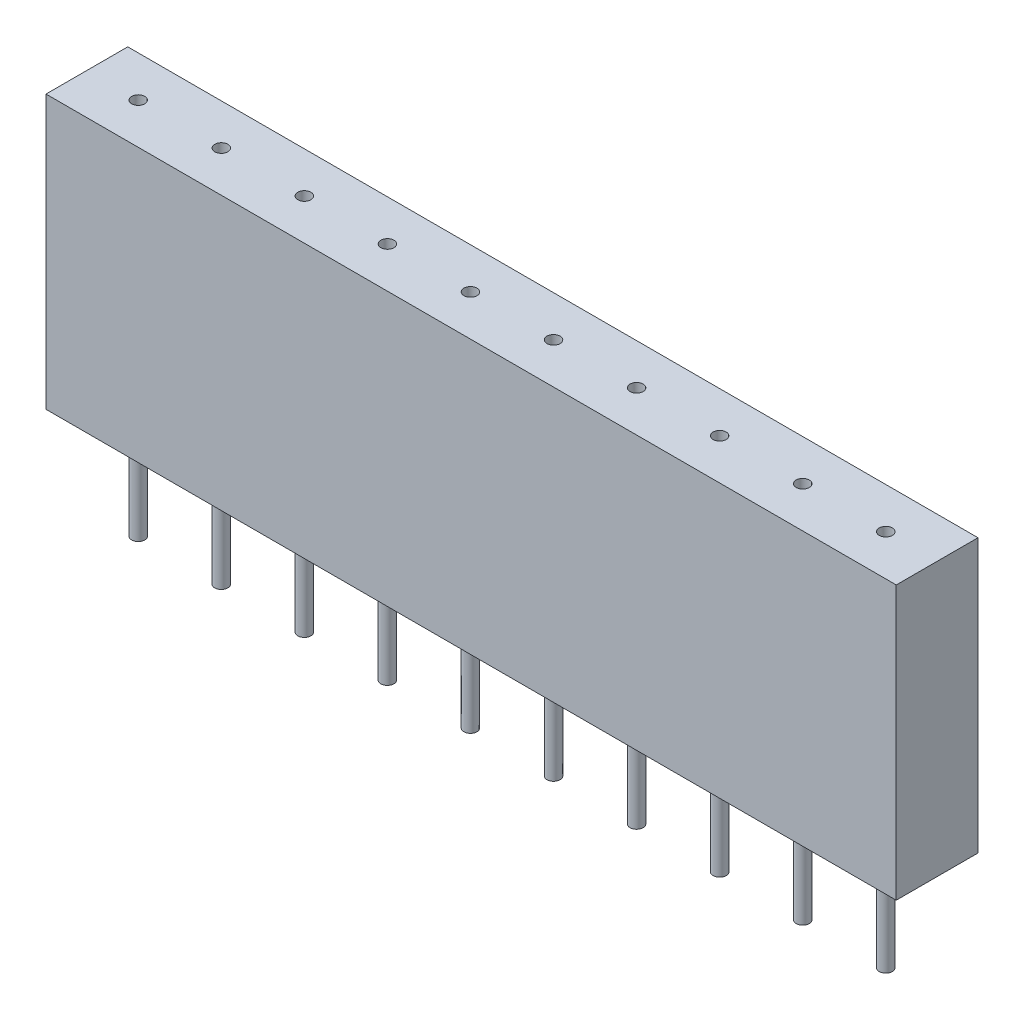
ISO-10303-21;
HEADER;
FILE_DESCRIPTION(('STEP AP214'),'2;1');
FILE_NAME('part.step','',(''),(''),'','','');
FILE_SCHEMA(('AUTOMOTIVE_DESIGN { 1 0 10303 214 1 1 1 1 }'));
ENDSEC;
DATA;
#1=APPLICATION_CONTEXT('core data for automotive mechanical design processes');
#2=APPLICATION_PROTOCOL_DEFINITION('international standard','automotive_design',2000,#1);
#3=PRODUCT_CONTEXT('',#1,'mechanical');
#4=PRODUCT('Part','Part','',(#3));
#5=PRODUCT_RELATED_PRODUCT_CATEGORY('part','',(#4));
#6=PRODUCT_DEFINITION_FORMATION('','',#4);
#7=PRODUCT_DEFINITION_CONTEXT('part definition',#1,'design');
#8=PRODUCT_DEFINITION('design','',#6,#7);
#9=PRODUCT_DEFINITION_SHAPE('','',#8);
#10=(LENGTH_UNIT() NAMED_UNIT(*) SI_UNIT(.MILLI.,.METRE.));
#11=(NAMED_UNIT(*) PLANE_ANGLE_UNIT() SI_UNIT($,.RADIAN.));
#12=(NAMED_UNIT(*) SI_UNIT($,.STERADIAN.) SOLID_ANGLE_UNIT());
#13=UNCERTAINTY_MEASURE_WITH_UNIT(LENGTH_MEASURE(1.E-05),#10,'distance_accuracy_value','');
#14=(GEOMETRIC_REPRESENTATION_CONTEXT(3) GLOBAL_UNCERTAINTY_ASSIGNED_CONTEXT((#13)) GLOBAL_UNIT_ASSIGNED_CONTEXT((#10,
#11,#12)) REPRESENTATION_CONTEXT('',''));
#15=CARTESIAN_POINT('',(0.,0.,0.));
#16=DIRECTION('',(0.,0.,1.));
#17=DIRECTION('',(1.,0.,0.));
#18=AXIS2_PLACEMENT_3D('',#15,#16,#17);
#19=CARTESIAN_POINT('',(13.,8.35,1.25));
#20=DIRECTION('',(-1.,0.,0.));
#21=DIRECTION('',(0.,0.,1.));
#22=AXIS2_PLACEMENT_3D('',#19,#20,#21);
#23=PLANE('',#22);
#24=DIRECTION('',(0.,0.,-1.));
#25=VECTOR('',#24,1.);
#26=CARTESIAN_POINT('',(13.,0.,1.25));
#27=LINE('',#26,#25);
#28=CARTESIAN_POINT('',(13.,0.,1.25));
#29=VERTEX_POINT('',#28);
#30=CARTESIAN_POINT('',(13.,0.,-1.25));
#31=VERTEX_POINT('',#30);
#32=EDGE_CURVE('E113',#29,#31,#27,.T.);
#33=ORIENTED_EDGE('',*,*,#32,.T.);
#34=DIRECTION('',(0.,-1.,0.));
#35=VECTOR('',#34,1.);
#36=CARTESIAN_POINT('',(13.,8.35,-1.25));
#37=LINE('',#36,#35);
#38=CARTESIAN_POINT('',(13.,8.35,-1.25));
#39=VERTEX_POINT('',#38);
#40=EDGE_CURVE('E11',#39,#31,#37,.T.);
#41=ORIENTED_EDGE('',*,*,#40,.F.);
#42=DIRECTION('',(0.,0.,-1.));
#43=VECTOR('',#42,1.);
#44=CARTESIAN_POINT('',(13.,8.35,1.25));
#45=LINE('',#44,#43);
#46=CARTESIAN_POINT('',(13.,8.35,1.25));
#47=VERTEX_POINT('',#46);
#48=EDGE_CURVE('E97',#47,#39,#45,.T.);
#49=ORIENTED_EDGE('',*,*,#48,.F.);
#50=DIRECTION('',(0.,-1.,0.));
#51=VECTOR('',#50,1.);
#52=CARTESIAN_POINT('',(13.,8.35,1.25));
#53=LINE('',#52,#51);
#54=EDGE_CURVE('E109',#47,#29,#53,.T.);
#55=ORIENTED_EDGE('',*,*,#54,.T.);
#56=EDGE_LOOP('',(#33,#41,#49,#55));
#57=FACE_BOUND('',#56,.T.);
#58=ADVANCED_FACE('F45',(#57),#23,.F.);
#59=CARTESIAN_POINT('',(-13.,8.35,-1.25));
#60=DIRECTION('',(0.,0.,1.));
#61=DIRECTION('',(1.,0.,0.));
#62=AXIS2_PLACEMENT_3D('',#59,#60,#61);
#63=PLANE('',#62);
#64=DIRECTION('',(-1.,0.,0.));
#65=VECTOR('',#64,1.);
#66=CARTESIAN_POINT('',(-13.,0.,-1.25));
#67=LINE('',#66,#65);
#68=CARTESIAN_POINT('',(-13.,0.,-1.25));
#69=VERTEX_POINT('',#68);
#70=EDGE_CURVE('E102',#31,#69,#67,.T.);
#71=ORIENTED_EDGE('',*,*,#70,.T.);
#72=DIRECTION('',(0.,-1.,0.));
#73=VECTOR('',#72,1.);
#74=CARTESIAN_POINT('',(-13.,8.35,-1.25));
#75=LINE('',#74,#73);
#76=CARTESIAN_POINT('',(-13.,8.35,-1.25));
#77=VERTEX_POINT('',#76);
#78=EDGE_CURVE('E54',#77,#69,#75,.T.);
#79=ORIENTED_EDGE('',*,*,#78,.F.);
#80=DIRECTION('',(-1.,0.,0.));
#81=VECTOR('',#80,1.);
#82=CARTESIAN_POINT('',(-13.,8.35,-1.25));
#83=LINE('',#82,#81);
#84=EDGE_CURVE('E92',#39,#77,#83,.T.);
#85=ORIENTED_EDGE('',*,*,#84,.F.);
#86=ORIENTED_EDGE('',*,*,#40,.T.);
#87=EDGE_LOOP('',(#71,#79,#85,#86));
#88=FACE_BOUND('',#87,.T.);
#89=ADVANCED_FACE('F101',(#88),#63,.F.);
#90=CARTESIAN_POINT('',(-13.,8.35,1.25));
#91=DIRECTION('',(1.,0.,0.));
#92=DIRECTION('',(0.,0.,-1.));
#93=AXIS2_PLACEMENT_3D('',#90,#91,#92);
#94=PLANE('',#93);
#95=DIRECTION('',(0.,0.,1.));
#96=VECTOR('',#95,1.);
#97=CARTESIAN_POINT('',(-13.,0.,1.25));
#98=LINE('',#97,#96);
#99=CARTESIAN_POINT('',(-13.,0.,1.25));
#100=VERTEX_POINT('',#99);
#101=EDGE_CURVE('E79',#69,#100,#98,.T.);
#102=ORIENTED_EDGE('',*,*,#101,.T.);
#103=DIRECTION('',(0.,-1.,0.));
#104=VECTOR('',#103,1.);
#105=CARTESIAN_POINT('',(-13.,8.35,1.25));
#106=LINE('',#105,#104);
#107=CARTESIAN_POINT('',(-13.,8.35,1.25));
#108=VERTEX_POINT('',#107);
#109=EDGE_CURVE('E104',#108,#100,#106,.T.);
#110=ORIENTED_EDGE('',*,*,#109,.F.);
#111=DIRECTION('',(0.,0.,1.));
#112=VECTOR('',#111,1.);
#113=CARTESIAN_POINT('',(-13.,8.35,1.25));
#114=LINE('',#113,#112);
#115=EDGE_CURVE('E95',#77,#108,#114,.T.);
#116=ORIENTED_EDGE('',*,*,#115,.F.);
#117=ORIENTED_EDGE('',*,*,#78,.T.);
#118=EDGE_LOOP('',(#102,#110,#116,#117));
#119=FACE_BOUND('',#118,.T.);
#120=ADVANCED_FACE('F105',(#119),#94,.F.);
#121=CARTESIAN_POINT('',(-13.,8.35,1.25));
#122=DIRECTION('',(0.,0.,-1.));
#123=DIRECTION('',(-1.,0.,0.));
#124=AXIS2_PLACEMENT_3D('',#121,#122,#123);
#125=PLANE('',#124);
#126=DIRECTION('',(1.,0.,0.));
#127=VECTOR('',#126,1.);
#128=CARTESIAN_POINT('',(-13.,0.,1.25));
#129=LINE('',#128,#127);
#130=EDGE_CURVE('E85',#100,#29,#129,.T.);
#131=ORIENTED_EDGE('',*,*,#130,.T.);
#132=ORIENTED_EDGE('',*,*,#54,.F.);
#133=DIRECTION('',(1.,0.,0.));
#134=VECTOR('',#133,1.);
#135=CARTESIAN_POINT('',(-13.,8.35,1.25));
#136=LINE('',#135,#134);
#137=EDGE_CURVE('E62',#108,#47,#136,.T.);
#138=ORIENTED_EDGE('',*,*,#137,.F.);
#139=ORIENTED_EDGE('',*,*,#109,.T.);
#140=EDGE_LOOP('',(#131,#132,#138,#139));
#141=FACE_BOUND('',#140,.T.);
#142=ADVANCED_FACE('F127',(#141),#125,.F.);
#143=CARTESIAN_POINT('',(0.,8.35,0.));
#144=DIRECTION('',(0.,-1.,0.));
#145=DIRECTION('',(0.,0.,-1.));
#146=AXIS2_PLACEMENT_3D('',#143,#144,#145);
#147=PLANE('',#146);
#148=CARTESIAN_POINT('',(11.43,8.35,0.));
#149=DIRECTION('',(0.,1.,0.));
#150=DIRECTION('',(0.,0.,1.));
#151=AXIS2_PLACEMENT_3D('',#148,#149,#150);
#152=CIRCLE('',#151,0.200000000000001);
#153=CARTESIAN_POINT('',(11.43,8.35,0.200000000000001));
#154=VERTEX_POINT('',#153);
#155=EDGE_CURVE('E217',#154,#154,#152,.T.);
#156=ORIENTED_EDGE('',*,*,#155,.F.);
#157=EDGE_LOOP('',(#156));
#158=FACE_BOUND('',#157,.T.);
#159=CARTESIAN_POINT('',(8.89000000000001,8.35,0.));
#160=DIRECTION('',(0.,1.,0.));
#161=DIRECTION('',(0.,0.,1.));
#162=AXIS2_PLACEMENT_3D('',#159,#160,#161);
#163=CIRCLE('',#162,0.200000000000001);
#164=CARTESIAN_POINT('',(8.89000000000001,8.35,0.200000000000001));
#165=VERTEX_POINT('',#164);
#166=EDGE_CURVE('E209',#165,#165,#163,.T.);
#167=ORIENTED_EDGE('',*,*,#166,.F.);
#168=EDGE_LOOP('',(#167));
#169=FACE_BOUND('',#168,.T.);
#170=CARTESIAN_POINT('',(6.35,8.35,0.));
#171=DIRECTION('',(0.,1.,0.));
#172=DIRECTION('',(0.,0.,1.));
#173=AXIS2_PLACEMENT_3D('',#170,#171,#172);
#174=CIRCLE('',#173,0.200000000000001);
#175=CARTESIAN_POINT('',(6.35,8.35,0.200000000000001));
#176=VERTEX_POINT('',#175);
#177=EDGE_CURVE('E201',#176,#176,#174,.T.);
#178=ORIENTED_EDGE('',*,*,#177,.F.);
#179=EDGE_LOOP('',(#178));
#180=FACE_BOUND('',#179,.T.);
#181=CARTESIAN_POINT('',(3.81,8.35,0.));
#182=DIRECTION('',(0.,1.,0.));
#183=DIRECTION('',(0.,0.,1.));
#184=AXIS2_PLACEMENT_3D('',#181,#182,#183);
#185=CIRCLE('',#184,0.200000000000001);
#186=CARTESIAN_POINT('',(3.81,8.35,0.200000000000001));
#187=VERTEX_POINT('',#186);
#188=EDGE_CURVE('E193',#187,#187,#185,.T.);
#189=ORIENTED_EDGE('',*,*,#188,.F.);
#190=EDGE_LOOP('',(#189));
#191=FACE_BOUND('',#190,.T.);
#192=CARTESIAN_POINT('',(1.27000000000001,8.35,0.));
#193=DIRECTION('',(0.,1.,0.));
#194=DIRECTION('',(0.,0.,1.));
#195=AXIS2_PLACEMENT_3D('',#192,#193,#194);
#196=CIRCLE('',#195,0.200000000000001);
#197=CARTESIAN_POINT('',(1.27000000000001,8.35,0.200000000000001));
#198=VERTEX_POINT('',#197);
#199=EDGE_CURVE('E185',#198,#198,#196,.T.);
#200=ORIENTED_EDGE('',*,*,#199,.F.);
#201=EDGE_LOOP('',(#200));
#202=FACE_BOUND('',#201,.T.);
#203=CARTESIAN_POINT('',(-1.27,8.35,0.));
#204=DIRECTION('',(0.,1.,0.));
#205=DIRECTION('',(0.,0.,1.));
#206=AXIS2_PLACEMENT_3D('',#203,#204,#205);
#207=CIRCLE('',#206,0.200000000000001);
#208=CARTESIAN_POINT('',(-1.27,8.35,0.200000000000001));
#209=VERTEX_POINT('',#208);
#210=EDGE_CURVE('E177',#209,#209,#207,.T.);
#211=ORIENTED_EDGE('',*,*,#210,.F.);
#212=EDGE_LOOP('',(#211));
#213=FACE_BOUND('',#212,.T.);
#214=CARTESIAN_POINT('',(-3.81,8.35,0.));
#215=DIRECTION('',(0.,1.,0.));
#216=DIRECTION('',(0.,0.,1.));
#217=AXIS2_PLACEMENT_3D('',#214,#215,#216);
#218=CIRCLE('',#217,0.200000000000001);
#219=CARTESIAN_POINT('',(-3.81,8.35,0.200000000000001));
#220=VERTEX_POINT('',#219);
#221=EDGE_CURVE('E169',#220,#220,#218,.T.);
#222=ORIENTED_EDGE('',*,*,#221,.F.);
#223=EDGE_LOOP('',(#222));
#224=FACE_BOUND('',#223,.T.);
#225=CARTESIAN_POINT('',(-6.35,8.35,0.));
#226=DIRECTION('',(0.,1.,0.));
#227=DIRECTION('',(0.,0.,1.));
#228=AXIS2_PLACEMENT_3D('',#225,#226,#227);
#229=CIRCLE('',#228,0.200000000000001);
#230=CARTESIAN_POINT('',(-6.35,8.35,0.200000000000001));
#231=VERTEX_POINT('',#230);
#232=EDGE_CURVE('E161',#231,#231,#229,.T.);
#233=ORIENTED_EDGE('',*,*,#232,.F.);
#234=EDGE_LOOP('',(#233));
#235=FACE_BOUND('',#234,.T.);
#236=CARTESIAN_POINT('',(-8.89,8.35,0.));
#237=DIRECTION('',(0.,1.,0.));
#238=DIRECTION('',(0.,0.,1.));
#239=AXIS2_PLACEMENT_3D('',#236,#237,#238);
#240=CIRCLE('',#239,0.200000000000001);
#241=CARTESIAN_POINT('',(-8.89,8.35,0.200000000000001));
#242=VERTEX_POINT('',#241);
#243=EDGE_CURVE('E153',#242,#242,#240,.T.);
#244=ORIENTED_EDGE('',*,*,#243,.F.);
#245=EDGE_LOOP('',(#244));
#246=FACE_BOUND('',#245,.T.);
#247=CARTESIAN_POINT('',(-11.43,8.35,0.));
#248=DIRECTION('',(0.,1.,0.));
#249=DIRECTION('',(0.,0.,1.));
#250=AXIS2_PLACEMENT_3D('',#247,#248,#249);
#251=CIRCLE('',#250,0.200000000000001);
#252=CARTESIAN_POINT('',(-11.43,8.35,0.200000000000001));
#253=VERTEX_POINT('',#252);
#254=EDGE_CURVE('E134',#253,#253,#251,.T.);
#255=ORIENTED_EDGE('',*,*,#254,.F.);
#256=EDGE_LOOP('',(#255));
#257=FACE_BOUND('',#256,.T.);
#258=ORIENTED_EDGE('',*,*,#48,.T.);
#259=ORIENTED_EDGE('',*,*,#84,.T.);
#260=ORIENTED_EDGE('',*,*,#115,.T.);
#261=ORIENTED_EDGE('',*,*,#137,.T.);
#262=EDGE_LOOP('',(#258,#259,#260,#261));
#263=FACE_BOUND('',#262,.T.);
#264=ADVANCED_FACE('F93',(#158,#169,#180,#191,#202,#213,#224,#235,#246,#257,#263),#147,.F.);
#265=CARTESIAN_POINT('',(0.,0.,0.));
#266=DIRECTION('',(0.,-1.,0.));
#267=DIRECTION('',(0.,0.,-1.));
#268=AXIS2_PLACEMENT_3D('',#265,#266,#267);
#269=PLANE('',#268);
#270=CARTESIAN_POINT('',(11.43,0.,0.));
#271=DIRECTION('',(0.,-1.,0.));
#272=DIRECTION('',(0.,0.,-1.));
#273=AXIS2_PLACEMENT_3D('',#270,#271,#272);
#274=CIRCLE('',#273,0.200000000000001);
#275=CARTESIAN_POINT('',(11.43,0.,-0.200000000000001));
#276=VERTEX_POINT('',#275);
#277=EDGE_CURVE('E286',#276,#276,#274,.T.);
#278=ORIENTED_EDGE('',*,*,#277,.F.);
#279=EDGE_LOOP('',(#278));
#280=FACE_BOUND('',#279,.T.);
#281=CARTESIAN_POINT('',(8.89000000000001,0.,0.));
#282=DIRECTION('',(0.,-1.,0.));
#283=DIRECTION('',(0.,0.,-1.));
#284=AXIS2_PLACEMENT_3D('',#281,#282,#283);
#285=CIRCLE('',#284,0.200000000000001);
#286=CARTESIAN_POINT('',(8.89000000000001,0.,-0.200000000000001));
#287=VERTEX_POINT('',#286);
#288=EDGE_CURVE('E278',#287,#287,#285,.T.);
#289=ORIENTED_EDGE('',*,*,#288,.F.);
#290=EDGE_LOOP('',(#289));
#291=FACE_BOUND('',#290,.T.);
#292=CARTESIAN_POINT('',(6.35,0.,0.));
#293=DIRECTION('',(0.,-1.,0.));
#294=DIRECTION('',(0.,0.,-1.));
#295=AXIS2_PLACEMENT_3D('',#292,#293,#294);
#296=CIRCLE('',#295,0.200000000000001);
#297=CARTESIAN_POINT('',(6.35,0.,-0.200000000000001));
#298=VERTEX_POINT('',#297);
#299=EDGE_CURVE('E270',#298,#298,#296,.T.);
#300=ORIENTED_EDGE('',*,*,#299,.F.);
#301=EDGE_LOOP('',(#300));
#302=FACE_BOUND('',#301,.T.);
#303=CARTESIAN_POINT('',(3.81,0.,0.));
#304=DIRECTION('',(0.,-1.,0.));
#305=DIRECTION('',(0.,0.,-1.));
#306=AXIS2_PLACEMENT_3D('',#303,#304,#305);
#307=CIRCLE('',#306,0.200000000000001);
#308=CARTESIAN_POINT('',(3.81,0.,-0.200000000000001));
#309=VERTEX_POINT('',#308);
#310=EDGE_CURVE('E262',#309,#309,#307,.T.);
#311=ORIENTED_EDGE('',*,*,#310,.F.);
#312=EDGE_LOOP('',(#311));
#313=FACE_BOUND('',#312,.T.);
#314=CARTESIAN_POINT('',(1.27000000000001,0.,0.));
#315=DIRECTION('',(0.,-1.,0.));
#316=DIRECTION('',(0.,0.,-1.));
#317=AXIS2_PLACEMENT_3D('',#314,#315,#316);
#318=CIRCLE('',#317,0.200000000000001);
#319=CARTESIAN_POINT('',(1.27000000000001,0.,-0.200000000000001));
#320=VERTEX_POINT('',#319);
#321=EDGE_CURVE('E254',#320,#320,#318,.T.);
#322=ORIENTED_EDGE('',*,*,#321,.F.);
#323=EDGE_LOOP('',(#322));
#324=FACE_BOUND('',#323,.T.);
#325=CARTESIAN_POINT('',(-1.27,0.,0.));
#326=DIRECTION('',(0.,-1.,0.));
#327=DIRECTION('',(0.,0.,-1.));
#328=AXIS2_PLACEMENT_3D('',#325,#326,#327);
#329=CIRCLE('',#328,0.200000000000001);
#330=CARTESIAN_POINT('',(-1.27,0.,-0.200000000000001));
#331=VERTEX_POINT('',#330);
#332=EDGE_CURVE('E246',#331,#331,#329,.T.);
#333=ORIENTED_EDGE('',*,*,#332,.F.);
#334=EDGE_LOOP('',(#333));
#335=FACE_BOUND('',#334,.T.);
#336=CARTESIAN_POINT('',(-3.81,0.,0.));
#337=DIRECTION('',(0.,-1.,0.));
#338=DIRECTION('',(0.,0.,-1.));
#339=AXIS2_PLACEMENT_3D('',#336,#337,#338);
#340=CIRCLE('',#339,0.200000000000001);
#341=CARTESIAN_POINT('',(-3.81,0.,-0.200000000000001));
#342=VERTEX_POINT('',#341);
#343=EDGE_CURVE('E238',#342,#342,#340,.T.);
#344=ORIENTED_EDGE('',*,*,#343,.F.);
#345=EDGE_LOOP('',(#344));
#346=FACE_BOUND('',#345,.T.);
#347=CARTESIAN_POINT('',(-6.35,0.,0.));
#348=DIRECTION('',(0.,-1.,0.));
#349=DIRECTION('',(0.,0.,-1.));
#350=AXIS2_PLACEMENT_3D('',#347,#348,#349);
#351=CIRCLE('',#350,0.200000000000001);
#352=CARTESIAN_POINT('',(-6.35,0.,-0.200000000000001));
#353=VERTEX_POINT('',#352);
#354=EDGE_CURVE('E230',#353,#353,#351,.T.);
#355=ORIENTED_EDGE('',*,*,#354,.F.);
#356=EDGE_LOOP('',(#355));
#357=FACE_BOUND('',#356,.T.);
#358=CARTESIAN_POINT('',(-8.89,0.,0.));
#359=DIRECTION('',(0.,-1.,0.));
#360=DIRECTION('',(0.,0.,-1.));
#361=AXIS2_PLACEMENT_3D('',#358,#359,#360);
#362=CIRCLE('',#361,0.200000000000001);
#363=CARTESIAN_POINT('',(-8.89,0.,-0.200000000000001));
#364=VERTEX_POINT('',#363);
#365=EDGE_CURVE('E222',#364,#364,#362,.T.);
#366=ORIENTED_EDGE('',*,*,#365,.F.);
#367=EDGE_LOOP('',(#366));
#368=FACE_BOUND('',#367,.T.);
#369=CARTESIAN_POINT('',(-11.43,0.,0.));
#370=DIRECTION('',(0.,-1.,0.));
#371=DIRECTION('',(0.,0.,-1.));
#372=AXIS2_PLACEMENT_3D('',#369,#370,#371);
#373=CIRCLE('',#372,0.200000000000001);
#374=CARTESIAN_POINT('',(-11.43,0.,-0.200000000000001));
#375=VERTEX_POINT('',#374);
#376=EDGE_CURVE('E142',#375,#375,#373,.T.);
#377=ORIENTED_EDGE('',*,*,#376,.F.);
#378=EDGE_LOOP('',(#377));
#379=FACE_BOUND('',#378,.T.);
#380=ORIENTED_EDGE('',*,*,#32,.F.);
#381=ORIENTED_EDGE('',*,*,#130,.F.);
#382=ORIENTED_EDGE('',*,*,#101,.F.);
#383=ORIENTED_EDGE('',*,*,#70,.F.);
#384=EDGE_LOOP('',(#380,#381,#382,#383));
#385=FACE_BOUND('',#384,.T.);
#386=ADVANCED_FACE('F130',(#280,#291,#302,#313,#324,#335,#346,#357,#368,#379,#385),#269,.T.);
#387=CARTESIAN_POINT('',(-11.43,5.35,0.));
#388=DIRECTION('',(0.,1.,0.));
#389=DIRECTION('',(0.,0.,1.));
#390=AXIS2_PLACEMENT_3D('',#387,#388,#389);
#391=CYLINDRICAL_SURFACE('',#390,0.200000000000001);
#392=CARTESIAN_POINT('',(-11.43,5.35,0.));
#393=DIRECTION('',(0.,1.,0.));
#394=DIRECTION('',(0.,0.,1.));
#395=AXIS2_PLACEMENT_3D('',#392,#393,#394);
#396=CIRCLE('',#395,0.200000000000001);
#397=CARTESIAN_POINT('',(-11.43,5.35,0.200000000000001));
#398=VERTEX_POINT('',#397);
#399=EDGE_CURVE('E117',#398,#398,#396,.T.);
#400=ORIENTED_EDGE('',*,*,#399,.F.);
#401=EDGE_LOOP('',(#400));
#402=FACE_BOUND('',#401,.T.);
#403=ORIENTED_EDGE('',*,*,#254,.T.);
#404=EDGE_LOOP('',(#403));
#405=FACE_BOUND('',#404,.T.);
#406=ADVANCED_FACE('F305',(#402,#405),#391,.F.);
#407=CARTESIAN_POINT('',(-11.43,5.35,0.));
#408=DIRECTION('',(0.,1.,0.));
#409=DIRECTION('',(0.,0.,1.));
#410=AXIS2_PLACEMENT_3D('',#407,#408,#409);
#411=PLANE('',#410);
#412=ORIENTED_EDGE('',*,*,#399,.T.);
#413=EDGE_LOOP('',(#412));
#414=FACE_BOUND('',#413,.T.);
#415=ADVANCED_FACE('F328',(#414),#411,.T.);
#416=CARTESIAN_POINT('',(-11.43,-3.2,0.));
#417=DIRECTION('',(0.,1.,0.));
#418=DIRECTION('',(0.,0.,1.));
#419=AXIS2_PLACEMENT_3D('',#416,#417,#418);
#420=CYLINDRICAL_SURFACE('',#419,0.200000000000001);
#421=CARTESIAN_POINT('',(-11.43,-3.2,0.));
#422=DIRECTION('',(0.,-1.,0.));
#423=DIRECTION('',(0.,0.,-1.));
#424=AXIS2_PLACEMENT_3D('',#421,#422,#423);
#425=CIRCLE('',#424,0.200000000000001);
#426=CARTESIAN_POINT('',(-11.43,-3.2,-0.200000000000001));
#427=VERTEX_POINT('',#426);
#428=EDGE_CURVE('E138',#427,#427,#425,.T.);
#429=ORIENTED_EDGE('',*,*,#428,.F.);
#430=EDGE_LOOP('',(#429));
#431=FACE_BOUND('',#430,.T.);
#432=ORIENTED_EDGE('',*,*,#376,.T.);
#433=EDGE_LOOP('',(#432));
#434=FACE_BOUND('',#433,.T.);
#435=ADVANCED_FACE('F325',(#431,#434),#420,.T.);
#436=CARTESIAN_POINT('',(-11.43,-3.2,0.));
#437=DIRECTION('',(0.,-1.,0.));
#438=DIRECTION('',(0.,0.,-1.));
#439=AXIS2_PLACEMENT_3D('',#436,#437,#438);
#440=PLANE('',#439);
#441=ORIENTED_EDGE('',*,*,#428,.T.);
#442=EDGE_LOOP('',(#441));
#443=FACE_BOUND('',#442,.T.);
#444=ADVANCED_FACE('F327',(#443),#440,.T.);
#445=CARTESIAN_POINT('',(-8.89,5.35,0.));
#446=DIRECTION('',(0.,1.,0.));
#447=DIRECTION('',(0.,0.,1.));
#448=AXIS2_PLACEMENT_3D('',#445,#446,#447);
#449=CYLINDRICAL_SURFACE('',#448,0.200000000000001);
#450=CARTESIAN_POINT('',(-8.89,5.35,0.));
#451=DIRECTION('',(0.,1.,0.));
#452=DIRECTION('',(0.,0.,1.));
#453=AXIS2_PLACEMENT_3D('',#450,#451,#452);
#454=CIRCLE('',#453,0.200000000000001);
#455=CARTESIAN_POINT('',(-8.89,5.35,0.200000000000001));
#456=VERTEX_POINT('',#455);
#457=EDGE_CURVE('E146',#456,#456,#454,.T.);
#458=ORIENTED_EDGE('',*,*,#457,.F.);
#459=EDGE_LOOP('',(#458));
#460=FACE_BOUND('',#459,.T.);
#461=ORIENTED_EDGE('',*,*,#243,.T.);
#462=EDGE_LOOP('',(#461));
#463=FACE_BOUND('',#462,.T.);
#464=ADVANCED_FACE('F335',(#460,#463),#449,.F.);
#465=CARTESIAN_POINT('',(-8.89,5.35,0.));
#466=DIRECTION('',(0.,1.,0.));
#467=DIRECTION('',(0.,0.,1.));
#468=AXIS2_PLACEMENT_3D('',#465,#466,#467);
#469=PLANE('',#468);
#470=ORIENTED_EDGE('',*,*,#457,.T.);
#471=EDGE_LOOP('',(#470));
#472=FACE_BOUND('',#471,.T.);
#473=ADVANCED_FACE('F391',(#472),#469,.T.);
#474=CARTESIAN_POINT('',(-6.35,5.35,0.));
#475=DIRECTION('',(0.,1.,0.));
#476=DIRECTION('',(0.,0.,1.));
#477=AXIS2_PLACEMENT_3D('',#474,#475,#476);
#478=CYLINDRICAL_SURFACE('',#477,0.200000000000001);
#479=CARTESIAN_POINT('',(-6.35,5.35,0.));
#480=DIRECTION('',(0.,1.,0.));
#481=DIRECTION('',(0.,0.,1.));
#482=AXIS2_PLACEMENT_3D('',#479,#480,#481);
#483=CIRCLE('',#482,0.200000000000001);
#484=CARTESIAN_POINT('',(-6.35,5.35,0.200000000000001));
#485=VERTEX_POINT('',#484);
#486=EDGE_CURVE('E157',#485,#485,#483,.T.);
#487=ORIENTED_EDGE('',*,*,#486,.F.);
#488=EDGE_LOOP('',(#487));
#489=FACE_BOUND('',#488,.T.);
#490=ORIENTED_EDGE('',*,*,#232,.T.);
#491=EDGE_LOOP('',(#490));
#492=FACE_BOUND('',#491,.T.);
#493=ADVANCED_FACE('F401',(#489,#492),#478,.F.);
#494=CARTESIAN_POINT('',(-6.35,5.35,0.));
#495=DIRECTION('',(0.,1.,0.));
#496=DIRECTION('',(0.,0.,1.));
#497=AXIS2_PLACEMENT_3D('',#494,#495,#496);
#498=PLANE('',#497);
#499=ORIENTED_EDGE('',*,*,#486,.T.);
#500=EDGE_LOOP('',(#499));
#501=FACE_BOUND('',#500,.T.);
#502=ADVANCED_FACE('F411',(#501),#498,.T.);
#503=CARTESIAN_POINT('',(-3.81,5.35,0.));
#504=DIRECTION('',(0.,1.,0.));
#505=DIRECTION('',(0.,0.,1.));
#506=AXIS2_PLACEMENT_3D('',#503,#504,#505);
#507=CYLINDRICAL_SURFACE('',#506,0.200000000000001);
#508=CARTESIAN_POINT('',(-3.81,5.35,0.));
#509=DIRECTION('',(0.,1.,0.));
#510=DIRECTION('',(0.,0.,1.));
#511=AXIS2_PLACEMENT_3D('',#508,#509,#510);
#512=CIRCLE('',#511,0.200000000000001);
#513=CARTESIAN_POINT('',(-3.81,5.35,0.200000000000001));
#514=VERTEX_POINT('',#513);
#515=EDGE_CURVE('E165',#514,#514,#512,.T.);
#516=ORIENTED_EDGE('',*,*,#515,.F.);
#517=EDGE_LOOP('',(#516));
#518=FACE_BOUND('',#517,.T.);
#519=ORIENTED_EDGE('',*,*,#221,.T.);
#520=EDGE_LOOP('',(#519));
#521=FACE_BOUND('',#520,.T.);
#522=ADVANCED_FACE('F421',(#518,#521),#507,.F.);
#523=CARTESIAN_POINT('',(-3.81,5.35,0.));
#524=DIRECTION('',(0.,1.,0.));
#525=DIRECTION('',(0.,0.,1.));
#526=AXIS2_PLACEMENT_3D('',#523,#524,#525);
#527=PLANE('',#526);
#528=ORIENTED_EDGE('',*,*,#515,.T.);
#529=EDGE_LOOP('',(#528));
#530=FACE_BOUND('',#529,.T.);
#531=ADVANCED_FACE('F431',(#530),#527,.T.);
#532=CARTESIAN_POINT('',(-1.27,5.35,0.));
#533=DIRECTION('',(0.,1.,0.));
#534=DIRECTION('',(0.,0.,1.));
#535=AXIS2_PLACEMENT_3D('',#532,#533,#534);
#536=CYLINDRICAL_SURFACE('',#535,0.200000000000001);
#537=CARTESIAN_POINT('',(-1.27,5.35,0.));
#538=DIRECTION('',(0.,1.,0.));
#539=DIRECTION('',(0.,0.,1.));
#540=AXIS2_PLACEMENT_3D('',#537,#538,#539);
#541=CIRCLE('',#540,0.200000000000001);
#542=CARTESIAN_POINT('',(-1.27,5.35,0.200000000000001));
#543=VERTEX_POINT('',#542);
#544=EDGE_CURVE('E173',#543,#543,#541,.T.);
#545=ORIENTED_EDGE('',*,*,#544,.F.);
#546=EDGE_LOOP('',(#545));
#547=FACE_BOUND('',#546,.T.);
#548=ORIENTED_EDGE('',*,*,#210,.T.);
#549=EDGE_LOOP('',(#548));
#550=FACE_BOUND('',#549,.T.);
#551=ADVANCED_FACE('F441',(#547,#550),#536,.F.);
#552=CARTESIAN_POINT('',(-1.27,5.35,0.));
#553=DIRECTION('',(0.,1.,0.));
#554=DIRECTION('',(0.,0.,1.));
#555=AXIS2_PLACEMENT_3D('',#552,#553,#554);
#556=PLANE('',#555);
#557=ORIENTED_EDGE('',*,*,#544,.T.);
#558=EDGE_LOOP('',(#557));
#559=FACE_BOUND('',#558,.T.);
#560=ADVANCED_FACE('F451',(#559),#556,.T.);
#561=CARTESIAN_POINT('',(1.27000000000001,5.35,0.));
#562=DIRECTION('',(0.,1.,0.));
#563=DIRECTION('',(0.,0.,1.));
#564=AXIS2_PLACEMENT_3D('',#561,#562,#563);
#565=CYLINDRICAL_SURFACE('',#564,0.200000000000001);
#566=CARTESIAN_POINT('',(1.27000000000001,5.35,0.));
#567=DIRECTION('',(0.,1.,0.));
#568=DIRECTION('',(0.,0.,1.));
#569=AXIS2_PLACEMENT_3D('',#566,#567,#568);
#570=CIRCLE('',#569,0.200000000000001);
#571=CARTESIAN_POINT('',(1.27000000000001,5.35,0.200000000000001));
#572=VERTEX_POINT('',#571);
#573=EDGE_CURVE('E181',#572,#572,#570,.T.);
#574=ORIENTED_EDGE('',*,*,#573,.F.);
#575=EDGE_LOOP('',(#574));
#576=FACE_BOUND('',#575,.T.);
#577=ORIENTED_EDGE('',*,*,#199,.T.);
#578=EDGE_LOOP('',(#577));
#579=FACE_BOUND('',#578,.T.);
#580=ADVANCED_FACE('F461',(#576,#579),#565,.F.);
#581=CARTESIAN_POINT('',(1.27000000000001,5.35,0.));
#582=DIRECTION('',(0.,1.,0.));
#583=DIRECTION('',(0.,0.,1.));
#584=AXIS2_PLACEMENT_3D('',#581,#582,#583);
#585=PLANE('',#584);
#586=ORIENTED_EDGE('',*,*,#573,.T.);
#587=EDGE_LOOP('',(#586));
#588=FACE_BOUND('',#587,.T.);
#589=ADVANCED_FACE('F471',(#588),#585,.T.);
#590=CARTESIAN_POINT('',(3.81,5.35,0.));
#591=DIRECTION('',(0.,1.,0.));
#592=DIRECTION('',(0.,0.,1.));
#593=AXIS2_PLACEMENT_3D('',#590,#591,#592);
#594=CYLINDRICAL_SURFACE('',#593,0.200000000000001);
#595=CARTESIAN_POINT('',(3.81,5.35,0.));
#596=DIRECTION('',(0.,1.,0.));
#597=DIRECTION('',(0.,0.,1.));
#598=AXIS2_PLACEMENT_3D('',#595,#596,#597);
#599=CIRCLE('',#598,0.200000000000001);
#600=CARTESIAN_POINT('',(3.81,5.35,0.200000000000001));
#601=VERTEX_POINT('',#600);
#602=EDGE_CURVE('E189',#601,#601,#599,.T.);
#603=ORIENTED_EDGE('',*,*,#602,.F.);
#604=EDGE_LOOP('',(#603));
#605=FACE_BOUND('',#604,.T.);
#606=ORIENTED_EDGE('',*,*,#188,.T.);
#607=EDGE_LOOP('',(#606));
#608=FACE_BOUND('',#607,.T.);
#609=ADVANCED_FACE('F481',(#605,#608),#594,.F.);
#610=CARTESIAN_POINT('',(3.81,5.35,0.));
#611=DIRECTION('',(0.,1.,0.));
#612=DIRECTION('',(0.,0.,1.));
#613=AXIS2_PLACEMENT_3D('',#610,#611,#612);
#614=PLANE('',#613);
#615=ORIENTED_EDGE('',*,*,#602,.T.);
#616=EDGE_LOOP('',(#615));
#617=FACE_BOUND('',#616,.T.);
#618=ADVANCED_FACE('F491',(#617),#614,.T.);
#619=CARTESIAN_POINT('',(6.35,5.35,0.));
#620=DIRECTION('',(0.,1.,0.));
#621=DIRECTION('',(0.,0.,1.));
#622=AXIS2_PLACEMENT_3D('',#619,#620,#621);
#623=CYLINDRICAL_SURFACE('',#622,0.200000000000001);
#624=CARTESIAN_POINT('',(6.35,5.35,0.));
#625=DIRECTION('',(0.,1.,0.));
#626=DIRECTION('',(0.,0.,1.));
#627=AXIS2_PLACEMENT_3D('',#624,#625,#626);
#628=CIRCLE('',#627,0.200000000000001);
#629=CARTESIAN_POINT('',(6.35,5.35,0.200000000000001));
#630=VERTEX_POINT('',#629);
#631=EDGE_CURVE('E197',#630,#630,#628,.T.);
#632=ORIENTED_EDGE('',*,*,#631,.F.);
#633=EDGE_LOOP('',(#632));
#634=FACE_BOUND('',#633,.T.);
#635=ORIENTED_EDGE('',*,*,#177,.T.);
#636=EDGE_LOOP('',(#635));
#637=FACE_BOUND('',#636,.T.);
#638=ADVANCED_FACE('F501',(#634,#637),#623,.F.);
#639=CARTESIAN_POINT('',(6.35,5.35,0.));
#640=DIRECTION('',(0.,1.,0.));
#641=DIRECTION('',(0.,0.,1.));
#642=AXIS2_PLACEMENT_3D('',#639,#640,#641);
#643=PLANE('',#642);
#644=ORIENTED_EDGE('',*,*,#631,.T.);
#645=EDGE_LOOP('',(#644));
#646=FACE_BOUND('',#645,.T.);
#647=ADVANCED_FACE('F511',(#646),#643,.T.);
#648=CARTESIAN_POINT('',(8.89000000000001,5.35,0.));
#649=DIRECTION('',(0.,1.,0.));
#650=DIRECTION('',(0.,0.,1.));
#651=AXIS2_PLACEMENT_3D('',#648,#649,#650);
#652=CYLINDRICAL_SURFACE('',#651,0.200000000000001);
#653=CARTESIAN_POINT('',(8.89000000000001,5.35,0.));
#654=DIRECTION('',(0.,1.,0.));
#655=DIRECTION('',(0.,0.,1.));
#656=AXIS2_PLACEMENT_3D('',#653,#654,#655);
#657=CIRCLE('',#656,0.200000000000001);
#658=CARTESIAN_POINT('',(8.89000000000001,5.35,0.200000000000001));
#659=VERTEX_POINT('',#658);
#660=EDGE_CURVE('E205',#659,#659,#657,.T.);
#661=ORIENTED_EDGE('',*,*,#660,.F.);
#662=EDGE_LOOP('',(#661));
#663=FACE_BOUND('',#662,.T.);
#664=ORIENTED_EDGE('',*,*,#166,.T.);
#665=EDGE_LOOP('',(#664));
#666=FACE_BOUND('',#665,.T.);
#667=ADVANCED_FACE('F521',(#663,#666),#652,.F.);
#668=CARTESIAN_POINT('',(8.89000000000001,5.35,0.));
#669=DIRECTION('',(0.,1.,0.));
#670=DIRECTION('',(0.,0.,1.));
#671=AXIS2_PLACEMENT_3D('',#668,#669,#670);
#672=PLANE('',#671);
#673=ORIENTED_EDGE('',*,*,#660,.T.);
#674=EDGE_LOOP('',(#673));
#675=FACE_BOUND('',#674,.T.);
#676=ADVANCED_FACE('F531',(#675),#672,.T.);
#677=CARTESIAN_POINT('',(11.43,5.35,0.));
#678=DIRECTION('',(0.,1.,0.));
#679=DIRECTION('',(0.,0.,1.));
#680=AXIS2_PLACEMENT_3D('',#677,#678,#679);
#681=CYLINDRICAL_SURFACE('',#680,0.200000000000001);
#682=CARTESIAN_POINT('',(11.43,5.35,0.));
#683=DIRECTION('',(0.,1.,0.));
#684=DIRECTION('',(0.,0.,1.));
#685=AXIS2_PLACEMENT_3D('',#682,#683,#684);
#686=CIRCLE('',#685,0.200000000000001);
#687=CARTESIAN_POINT('',(11.43,5.35,0.200000000000001));
#688=VERTEX_POINT('',#687);
#689=EDGE_CURVE('E213',#688,#688,#686,.T.);
#690=ORIENTED_EDGE('',*,*,#689,.F.);
#691=EDGE_LOOP('',(#690));
#692=FACE_BOUND('',#691,.T.);
#693=ORIENTED_EDGE('',*,*,#155,.T.);
#694=EDGE_LOOP('',(#693));
#695=FACE_BOUND('',#694,.T.);
#696=ADVANCED_FACE('F541',(#692,#695),#681,.F.);
#697=CARTESIAN_POINT('',(11.43,5.35,0.));
#698=DIRECTION('',(0.,1.,0.));
#699=DIRECTION('',(0.,0.,1.));
#700=AXIS2_PLACEMENT_3D('',#697,#698,#699);
#701=PLANE('',#700);
#702=ORIENTED_EDGE('',*,*,#689,.T.);
#703=EDGE_LOOP('',(#702));
#704=FACE_BOUND('',#703,.T.);
#705=ADVANCED_FACE('F551',(#704),#701,.T.);
#706=CARTESIAN_POINT('',(-8.89,-3.2,0.));
#707=DIRECTION('',(0.,1.,0.));
#708=DIRECTION('',(0.,0.,1.));
#709=AXIS2_PLACEMENT_3D('',#706,#707,#708);
#710=CYLINDRICAL_SURFACE('',#709,0.200000000000001);
#711=CARTESIAN_POINT('',(-8.89,-3.2,0.));
#712=DIRECTION('',(0.,-1.,0.));
#713=DIRECTION('',(0.,0.,-1.));
#714=AXIS2_PLACEMENT_3D('',#711,#712,#713);
#715=CIRCLE('',#714,0.200000000000001);
#716=CARTESIAN_POINT('',(-8.89,-3.2,-0.200000000000001));
#717=VERTEX_POINT('',#716);
#718=EDGE_CURVE('E221',#717,#717,#715,.T.);
#719=ORIENTED_EDGE('',*,*,#718,.F.);
#720=EDGE_LOOP('',(#719));
#721=FACE_BOUND('',#720,.T.);
#722=ORIENTED_EDGE('',*,*,#365,.T.);
#723=EDGE_LOOP('',(#722));
#724=FACE_BOUND('',#723,.T.);
#725=ADVANCED_FACE('F561',(#721,#724),#710,.T.);
#726=CARTESIAN_POINT('',(-8.89,-3.2,0.));
#727=DIRECTION('',(0.,-1.,0.));
#728=DIRECTION('',(0.,0.,-1.));
#729=AXIS2_PLACEMENT_3D('',#726,#727,#728);
#730=PLANE('',#729);
#731=ORIENTED_EDGE('',*,*,#718,.T.);
#732=EDGE_LOOP('',(#731));
#733=FACE_BOUND('',#732,.T.);
#734=ADVANCED_FACE('F571',(#733),#730,.T.);
#735=CARTESIAN_POINT('',(-6.35,-3.2,0.));
#736=DIRECTION('',(0.,1.,0.));
#737=DIRECTION('',(0.,0.,1.));
#738=AXIS2_PLACEMENT_3D('',#735,#736,#737);
#739=CYLINDRICAL_SURFACE('',#738,0.200000000000001);
#740=CARTESIAN_POINT('',(-6.35,-3.2,0.));
#741=DIRECTION('',(0.,-1.,0.));
#742=DIRECTION('',(0.,0.,-1.));
#743=AXIS2_PLACEMENT_3D('',#740,#741,#742);
#744=CIRCLE('',#743,0.200000000000001);
#745=CARTESIAN_POINT('',(-6.35,-3.2,-0.200000000000001));
#746=VERTEX_POINT('',#745);
#747=EDGE_CURVE('E226',#746,#746,#744,.T.);
#748=ORIENTED_EDGE('',*,*,#747,.F.);
#749=EDGE_LOOP('',(#748));
#750=FACE_BOUND('',#749,.T.);
#751=ORIENTED_EDGE('',*,*,#354,.T.);
#752=EDGE_LOOP('',(#751));
#753=FACE_BOUND('',#752,.T.);
#754=ADVANCED_FACE('F581',(#750,#753),#739,.T.);
#755=CARTESIAN_POINT('',(-6.35,-3.2,0.));
#756=DIRECTION('',(0.,-1.,0.));
#757=DIRECTION('',(0.,0.,-1.));
#758=AXIS2_PLACEMENT_3D('',#755,#756,#757);
#759=PLANE('',#758);
#760=ORIENTED_EDGE('',*,*,#747,.T.);
#761=EDGE_LOOP('',(#760));
#762=FACE_BOUND('',#761,.T.);
#763=ADVANCED_FACE('F591',(#762),#759,.T.);
#764=CARTESIAN_POINT('',(-3.81,-3.2,0.));
#765=DIRECTION('',(0.,1.,0.));
#766=DIRECTION('',(0.,0.,1.));
#767=AXIS2_PLACEMENT_3D('',#764,#765,#766);
#768=CYLINDRICAL_SURFACE('',#767,0.200000000000001);
#769=CARTESIAN_POINT('',(-3.81,-3.2,0.));
#770=DIRECTION('',(0.,-1.,0.));
#771=DIRECTION('',(0.,0.,-1.));
#772=AXIS2_PLACEMENT_3D('',#769,#770,#771);
#773=CIRCLE('',#772,0.200000000000001);
#774=CARTESIAN_POINT('',(-3.81,-3.2,-0.200000000000001));
#775=VERTEX_POINT('',#774);
#776=EDGE_CURVE('E234',#775,#775,#773,.T.);
#777=ORIENTED_EDGE('',*,*,#776,.F.);
#778=EDGE_LOOP('',(#777));
#779=FACE_BOUND('',#778,.T.);
#780=ORIENTED_EDGE('',*,*,#343,.T.);
#781=EDGE_LOOP('',(#780));
#782=FACE_BOUND('',#781,.T.);
#783=ADVANCED_FACE('F601',(#779,#782),#768,.T.);
#784=CARTESIAN_POINT('',(-3.81,-3.2,0.));
#785=DIRECTION('',(0.,-1.,0.));
#786=DIRECTION('',(0.,0.,-1.));
#787=AXIS2_PLACEMENT_3D('',#784,#785,#786);
#788=PLANE('',#787);
#789=ORIENTED_EDGE('',*,*,#776,.T.);
#790=EDGE_LOOP('',(#789));
#791=FACE_BOUND('',#790,.T.);
#792=ADVANCED_FACE('F611',(#791),#788,.T.);
#793=CARTESIAN_POINT('',(-1.27,-3.2,0.));
#794=DIRECTION('',(0.,1.,0.));
#795=DIRECTION('',(0.,0.,1.));
#796=AXIS2_PLACEMENT_3D('',#793,#794,#795);
#797=CYLINDRICAL_SURFACE('',#796,0.200000000000001);
#798=CARTESIAN_POINT('',(-1.27,-3.2,0.));
#799=DIRECTION('',(0.,-1.,0.));
#800=DIRECTION('',(0.,0.,-1.));
#801=AXIS2_PLACEMENT_3D('',#798,#799,#800);
#802=CIRCLE('',#801,0.200000000000001);
#803=CARTESIAN_POINT('',(-1.27,-3.2,-0.200000000000001));
#804=VERTEX_POINT('',#803);
#805=EDGE_CURVE('E242',#804,#804,#802,.T.);
#806=ORIENTED_EDGE('',*,*,#805,.F.);
#807=EDGE_LOOP('',(#806));
#808=FACE_BOUND('',#807,.T.);
#809=ORIENTED_EDGE('',*,*,#332,.T.);
#810=EDGE_LOOP('',(#809));
#811=FACE_BOUND('',#810,.T.);
#812=ADVANCED_FACE('F621',(#808,#811),#797,.T.);
#813=CARTESIAN_POINT('',(-1.27,-3.2,0.));
#814=DIRECTION('',(0.,-1.,0.));
#815=DIRECTION('',(0.,0.,-1.));
#816=AXIS2_PLACEMENT_3D('',#813,#814,#815);
#817=PLANE('',#816);
#818=ORIENTED_EDGE('',*,*,#805,.T.);
#819=EDGE_LOOP('',(#818));
#820=FACE_BOUND('',#819,.T.);
#821=ADVANCED_FACE('F631',(#820),#817,.T.);
#822=CARTESIAN_POINT('',(1.27000000000001,-3.2,0.));
#823=DIRECTION('',(0.,1.,0.));
#824=DIRECTION('',(0.,0.,1.));
#825=AXIS2_PLACEMENT_3D('',#822,#823,#824);
#826=CYLINDRICAL_SURFACE('',#825,0.200000000000001);
#827=CARTESIAN_POINT('',(1.27000000000001,-3.2,0.));
#828=DIRECTION('',(0.,-1.,0.));
#829=DIRECTION('',(0.,0.,-1.));
#830=AXIS2_PLACEMENT_3D('',#827,#828,#829);
#831=CIRCLE('',#830,0.200000000000001);
#832=CARTESIAN_POINT('',(1.27000000000001,-3.2,-0.200000000000001));
#833=VERTEX_POINT('',#832);
#834=EDGE_CURVE('E250',#833,#833,#831,.T.);
#835=ORIENTED_EDGE('',*,*,#834,.F.);
#836=EDGE_LOOP('',(#835));
#837=FACE_BOUND('',#836,.T.);
#838=ORIENTED_EDGE('',*,*,#321,.T.);
#839=EDGE_LOOP('',(#838));
#840=FACE_BOUND('',#839,.T.);
#841=ADVANCED_FACE('F641',(#837,#840),#826,.T.);
#842=CARTESIAN_POINT('',(1.27000000000001,-3.2,0.));
#843=DIRECTION('',(0.,-1.,0.));
#844=DIRECTION('',(0.,0.,-1.));
#845=AXIS2_PLACEMENT_3D('',#842,#843,#844);
#846=PLANE('',#845);
#847=ORIENTED_EDGE('',*,*,#834,.T.);
#848=EDGE_LOOP('',(#847));
#849=FACE_BOUND('',#848,.T.);
#850=ADVANCED_FACE('F651',(#849),#846,.T.);
#851=CARTESIAN_POINT('',(3.81,-3.2,0.));
#852=DIRECTION('',(0.,1.,0.));
#853=DIRECTION('',(0.,0.,1.));
#854=AXIS2_PLACEMENT_3D('',#851,#852,#853);
#855=CYLINDRICAL_SURFACE('',#854,0.200000000000001);
#856=CARTESIAN_POINT('',(3.81,-3.2,0.));
#857=DIRECTION('',(0.,-1.,0.));
#858=DIRECTION('',(0.,0.,-1.));
#859=AXIS2_PLACEMENT_3D('',#856,#857,#858);
#860=CIRCLE('',#859,0.200000000000001);
#861=CARTESIAN_POINT('',(3.81,-3.2,-0.200000000000001));
#862=VERTEX_POINT('',#861);
#863=EDGE_CURVE('E258',#862,#862,#860,.T.);
#864=ORIENTED_EDGE('',*,*,#863,.F.);
#865=EDGE_LOOP('',(#864));
#866=FACE_BOUND('',#865,.T.);
#867=ORIENTED_EDGE('',*,*,#310,.T.);
#868=EDGE_LOOP('',(#867));
#869=FACE_BOUND('',#868,.T.);
#870=ADVANCED_FACE('F661',(#866,#869),#855,.T.);
#871=CARTESIAN_POINT('',(3.81,-3.2,0.));
#872=DIRECTION('',(0.,-1.,0.));
#873=DIRECTION('',(0.,0.,-1.));
#874=AXIS2_PLACEMENT_3D('',#871,#872,#873);
#875=PLANE('',#874);
#876=ORIENTED_EDGE('',*,*,#863,.T.);
#877=EDGE_LOOP('',(#876));
#878=FACE_BOUND('',#877,.T.);
#879=ADVANCED_FACE('F671',(#878),#875,.T.);
#880=CARTESIAN_POINT('',(6.35,-3.2,0.));
#881=DIRECTION('',(0.,1.,0.));
#882=DIRECTION('',(0.,0.,1.));
#883=AXIS2_PLACEMENT_3D('',#880,#881,#882);
#884=CYLINDRICAL_SURFACE('',#883,0.200000000000001);
#885=CARTESIAN_POINT('',(6.35,-3.2,0.));
#886=DIRECTION('',(0.,-1.,0.));
#887=DIRECTION('',(0.,0.,-1.));
#888=AXIS2_PLACEMENT_3D('',#885,#886,#887);
#889=CIRCLE('',#888,0.200000000000001);
#890=CARTESIAN_POINT('',(6.35,-3.2,-0.200000000000001));
#891=VERTEX_POINT('',#890);
#892=EDGE_CURVE('E266',#891,#891,#889,.T.);
#893=ORIENTED_EDGE('',*,*,#892,.F.);
#894=EDGE_LOOP('',(#893));
#895=FACE_BOUND('',#894,.T.);
#896=ORIENTED_EDGE('',*,*,#299,.T.);
#897=EDGE_LOOP('',(#896));
#898=FACE_BOUND('',#897,.T.);
#899=ADVANCED_FACE('F681',(#895,#898),#884,.T.);
#900=CARTESIAN_POINT('',(6.35,-3.2,0.));
#901=DIRECTION('',(0.,-1.,0.));
#902=DIRECTION('',(0.,0.,-1.));
#903=AXIS2_PLACEMENT_3D('',#900,#901,#902);
#904=PLANE('',#903);
#905=ORIENTED_EDGE('',*,*,#892,.T.);
#906=EDGE_LOOP('',(#905));
#907=FACE_BOUND('',#906,.T.);
#908=ADVANCED_FACE('F691',(#907),#904,.T.);
#909=CARTESIAN_POINT('',(8.89000000000001,-3.2,0.));
#910=DIRECTION('',(0.,1.,0.));
#911=DIRECTION('',(0.,0.,1.));
#912=AXIS2_PLACEMENT_3D('',#909,#910,#911);
#913=CYLINDRICAL_SURFACE('',#912,0.200000000000001);
#914=CARTESIAN_POINT('',(8.89000000000001,-3.2,0.));
#915=DIRECTION('',(0.,-1.,0.));
#916=DIRECTION('',(0.,0.,-1.));
#917=AXIS2_PLACEMENT_3D('',#914,#915,#916);
#918=CIRCLE('',#917,0.200000000000001);
#919=CARTESIAN_POINT('',(8.89000000000001,-3.2,-0.200000000000001));
#920=VERTEX_POINT('',#919);
#921=EDGE_CURVE('E274',#920,#920,#918,.T.);
#922=ORIENTED_EDGE('',*,*,#921,.F.);
#923=EDGE_LOOP('',(#922));
#924=FACE_BOUND('',#923,.T.);
#925=ORIENTED_EDGE('',*,*,#288,.T.);
#926=EDGE_LOOP('',(#925));
#927=FACE_BOUND('',#926,.T.);
#928=ADVANCED_FACE('F701',(#924,#927),#913,.T.);
#929=CARTESIAN_POINT('',(8.89000000000001,-3.2,0.));
#930=DIRECTION('',(0.,-1.,0.));
#931=DIRECTION('',(0.,0.,-1.));
#932=AXIS2_PLACEMENT_3D('',#929,#930,#931);
#933=PLANE('',#932);
#934=ORIENTED_EDGE('',*,*,#921,.T.);
#935=EDGE_LOOP('',(#934));
#936=FACE_BOUND('',#935,.T.);
#937=ADVANCED_FACE('F299',(#936),#933,.T.);
#938=CARTESIAN_POINT('',(11.43,-3.2,0.));
#939=DIRECTION('',(0.,1.,0.));
#940=DIRECTION('',(0.,0.,1.));
#941=AXIS2_PLACEMENT_3D('',#938,#939,#940);
#942=CYLINDRICAL_SURFACE('',#941,0.200000000000001);
#943=CARTESIAN_POINT('',(11.43,-3.2,0.));
#944=DIRECTION('',(0.,-1.,0.));
#945=DIRECTION('',(0.,0.,-1.));
#946=AXIS2_PLACEMENT_3D('',#943,#944,#945);
#947=CIRCLE('',#946,0.200000000000001);
#948=CARTESIAN_POINT('',(11.43,-3.2,-0.200000000000001));
#949=VERTEX_POINT('',#948);
#950=EDGE_CURVE('E282',#949,#949,#947,.T.);
#951=ORIENTED_EDGE('',*,*,#950,.F.);
#952=EDGE_LOOP('',(#951));
#953=FACE_BOUND('',#952,.T.);
#954=ORIENTED_EDGE('',*,*,#277,.T.);
#955=EDGE_LOOP('',(#954));
#956=FACE_BOUND('',#955,.T.);
#957=ADVANCED_FACE('F296',(#953,#956),#942,.T.);
#958=CARTESIAN_POINT('',(11.43,-3.2,0.));
#959=DIRECTION('',(0.,-1.,0.));
#960=DIRECTION('',(0.,0.,-1.));
#961=AXIS2_PLACEMENT_3D('',#958,#959,#960);
#962=PLANE('',#961);
#963=ORIENTED_EDGE('',*,*,#950,.T.);
#964=EDGE_LOOP('',(#963));
#965=FACE_BOUND('',#964,.T.);
#966=ADVANCED_FACE('F294',(#965),#962,.T.);
#967=CLOSED_SHELL('',(#58,#89,#120,#142,#264,#386,#406,#415,#435,#444,#464,#473,#493,#502,#522,
#531,#551,#560,#580,#589,#609,#618,#638,#647,#667,#676,#696,#705,#725,#734,#754,#763,#783,#792,
#812,#821,#841,#850,#870,#879,#899,#908,#928,#937,#957,#966));
#968=MANIFOLD_SOLID_BREP('B2',#967);
#969=ADVANCED_BREP_SHAPE_REPRESENTATION('',(#18,#968),#14);
#970=SHAPE_DEFINITION_REPRESENTATION(#9,#969);
ENDSEC;
END-ISO-10303-21;
